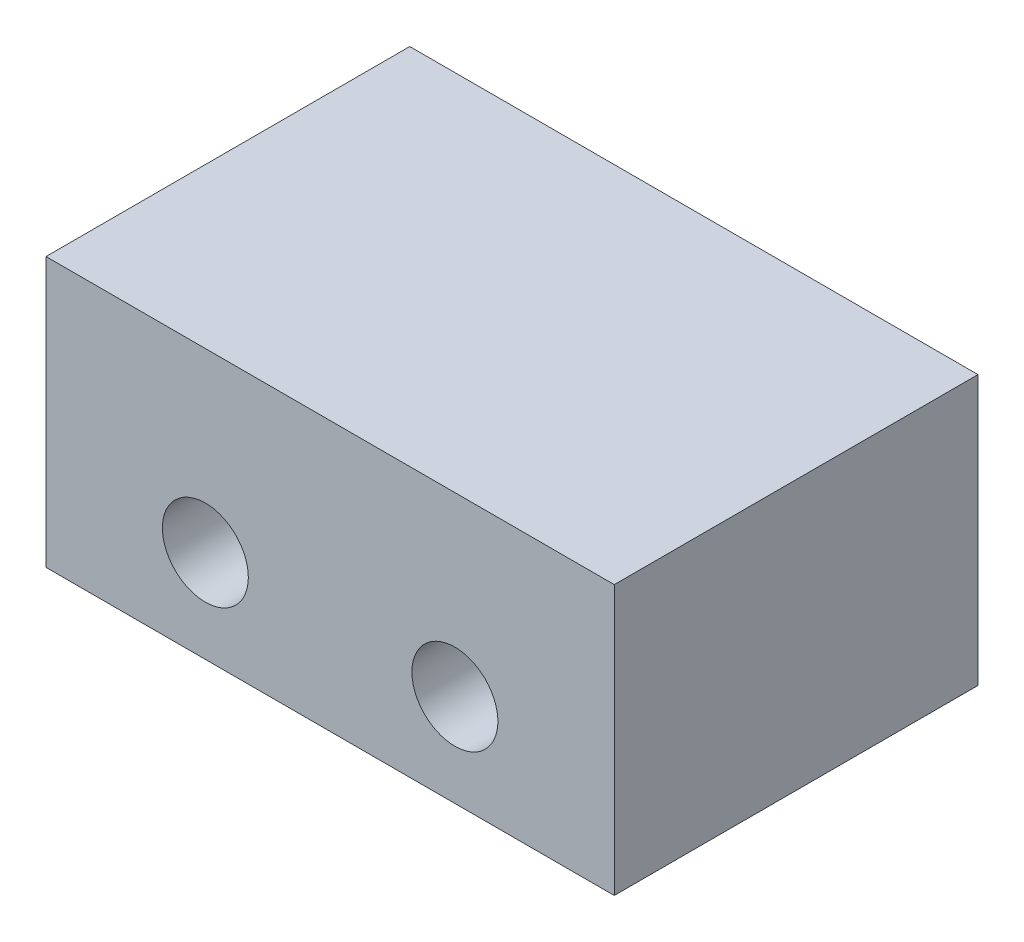
ISO-10303-21;
HEADER;
FILE_DESCRIPTION(('STEP AP214'),'2;1');
FILE_NAME('part.step','',(''),(''),'','','');
FILE_SCHEMA(('AUTOMOTIVE_DESIGN { 1 0 10303 214 1 1 1 1 }'));
ENDSEC;
DATA;
#1=APPLICATION_CONTEXT('core data for automotive mechanical design processes');
#2=APPLICATION_PROTOCOL_DEFINITION('international standard','automotive_design',2000,#1);
#3=PRODUCT_CONTEXT('',#1,'mechanical');
#4=PRODUCT('Part','Part','',(#3));
#5=PRODUCT_RELATED_PRODUCT_CATEGORY('part','',(#4));
#6=PRODUCT_DEFINITION_FORMATION('','',#4);
#7=PRODUCT_DEFINITION_CONTEXT('part definition',#1,'design');
#8=PRODUCT_DEFINITION('design','',#6,#7);
#9=PRODUCT_DEFINITION_SHAPE('','',#8);
#10=(LENGTH_UNIT() NAMED_UNIT(*) SI_UNIT(.MILLI.,.METRE.));
#11=(NAMED_UNIT(*) PLANE_ANGLE_UNIT() SI_UNIT($,.RADIAN.));
#12=(NAMED_UNIT(*) SI_UNIT($,.STERADIAN.) SOLID_ANGLE_UNIT());
#13=UNCERTAINTY_MEASURE_WITH_UNIT(LENGTH_MEASURE(1.E-05),#10,'distance_accuracy_value','');
#14=(GEOMETRIC_REPRESENTATION_CONTEXT(3) GLOBAL_UNCERTAINTY_ASSIGNED_CONTEXT((#13)) GLOBAL_UNIT_ASSIGNED_CONTEXT((#10,
#11,#12)) REPRESENTATION_CONTEXT('',''));
#15=CARTESIAN_POINT('',(0.,0.,0.));
#16=DIRECTION('',(0.,0.,1.));
#17=DIRECTION('',(1.,0.,0.));
#18=AXIS2_PLACEMENT_3D('',#15,#16,#17);
#19=CARTESIAN_POINT('',(0.,0.,12.7));
#20=DIRECTION('',(0.,0.,-1.));
#21=DIRECTION('',(-1.,0.,0.));
#22=AXIS2_PLACEMENT_3D('',#19,#20,#21);
#23=PLANE('',#22);
#24=DIRECTION('',(0.,-1.,0.));
#25=VECTOR('',#24,1.);
#26=CARTESIAN_POINT('',(0.,0.,12.7));
#27=LINE('',#26,#25);
#28=CARTESIAN_POINT('',(0.,9.4,12.7));
#29=VERTEX_POINT('',#28);
#30=CARTESIAN_POINT('',(0.,0.,12.7));
#31=VERTEX_POINT('',#30);
#32=EDGE_CURVE('E86',#29,#31,#27,.T.);
#33=ORIENTED_EDGE('',*,*,#32,.T.);
#34=DIRECTION('',(1.,0.,0.));
#35=VECTOR('',#34,1.);
#36=CARTESIAN_POINT('',(0.,0.,12.7));
#37=LINE('',#36,#35);
#38=CARTESIAN_POINT('',(19.84,0.,12.7));
#39=VERTEX_POINT('',#38);
#40=EDGE_CURVE('E81',#31,#39,#37,.T.);
#41=ORIENTED_EDGE('',*,*,#40,.T.);
#42=DIRECTION('',(0.,1.,0.));
#43=VECTOR('',#42,1.);
#44=CARTESIAN_POINT('',(19.84,0.,12.7));
#45=LINE('',#44,#43);
#46=CARTESIAN_POINT('',(19.84,9.4,12.7));
#47=VERTEX_POINT('',#46);
#48=EDGE_CURVE('E84',#39,#47,#45,.T.);
#49=ORIENTED_EDGE('',*,*,#48,.T.);
#50=DIRECTION('',(-1.,0.,0.));
#51=VECTOR('',#50,1.);
#52=CARTESIAN_POINT('',(0.,9.4,12.7));
#53=LINE('',#52,#51);
#54=EDGE_CURVE('E51',#47,#29,#53,.T.);
#55=ORIENTED_EDGE('',*,*,#54,.T.);
#56=EDGE_LOOP('',(#33,#41,#49,#55));
#57=FACE_BOUND('',#56,.T.);
#58=CARTESIAN_POINT('',(5.564,3.23,12.7));
#59=DIRECTION('',(0.,0.,1.));
#60=DIRECTION('',(1.,0.,0.));
#61=AXIS2_PLACEMENT_3D('',#58,#59,#60);
#62=CIRCLE('',#61,1.5);
#63=CARTESIAN_POINT('',(7.064,3.23,12.7));
#64=VERTEX_POINT('',#63);
#65=EDGE_CURVE('E101',#64,#64,#62,.T.);
#66=ORIENTED_EDGE('',*,*,#65,.F.);
#67=EDGE_LOOP('',(#66));
#68=FACE_BOUND('',#67,.T.);
#69=CARTESIAN_POINT('',(14.276,3.23,12.7));
#70=DIRECTION('',(0.,0.,1.));
#71=DIRECTION('',(-1.,0.,0.));
#72=AXIS2_PLACEMENT_3D('',#69,#70,#71);
#73=CIRCLE('',#72,1.5);
#74=CARTESIAN_POINT('',(12.776,3.23,12.7));
#75=VERTEX_POINT('',#74);
#76=EDGE_CURVE('E116',#75,#75,#73,.T.);
#77=ORIENTED_EDGE('',*,*,#76,.F.);
#78=EDGE_LOOP('',(#77));
#79=FACE_BOUND('',#78,.T.);
#80=ADVANCED_FACE('F34',(#57,#68,#79),#23,.F.);
#81=CARTESIAN_POINT('',(0.,0.,0.));
#82=DIRECTION('',(0.,0.,-1.));
#83=DIRECTION('',(-1.,0.,0.));
#84=AXIS2_PLACEMENT_3D('',#81,#82,#83);
#85=PLANE('',#84);
#86=CARTESIAN_POINT('',(5.564,3.23,0.));
#87=DIRECTION('',(0.,0.,1.));
#88=DIRECTION('',(1.,0.,0.));
#89=AXIS2_PLACEMENT_3D('',#86,#87,#88);
#90=CIRCLE('',#89,1.5);
#91=CARTESIAN_POINT('',(7.064,3.23,0.));
#92=VERTEX_POINT('',#91);
#93=EDGE_CURVE('E113',#92,#92,#90,.T.);
#94=ORIENTED_EDGE('',*,*,#93,.T.);
#95=EDGE_LOOP('',(#94));
#96=FACE_BOUND('',#95,.T.);
#97=DIRECTION('',(0.,-1.,0.));
#98=VECTOR('',#97,1.);
#99=CARTESIAN_POINT('',(0.,0.,0.));
#100=LINE('',#99,#98);
#101=CARTESIAN_POINT('',(0.,9.4,0.));
#102=VERTEX_POINT('',#101);
#103=CARTESIAN_POINT('',(0.,0.,0.));
#104=VERTEX_POINT('',#103);
#105=EDGE_CURVE('E98',#102,#104,#100,.T.);
#106=ORIENTED_EDGE('',*,*,#105,.F.);
#107=DIRECTION('',(-1.,0.,0.));
#108=VECTOR('',#107,1.);
#109=CARTESIAN_POINT('',(0.,9.4,0.));
#110=LINE('',#109,#108);
#111=CARTESIAN_POINT('',(19.84,9.4,0.));
#112=VERTEX_POINT('',#111);
#113=EDGE_CURVE('E74',#112,#102,#110,.T.);
#114=ORIENTED_EDGE('',*,*,#113,.F.);
#115=DIRECTION('',(0.,1.,0.));
#116=VECTOR('',#115,1.);
#117=CARTESIAN_POINT('',(19.84,0.,0.));
#118=LINE('',#117,#116);
#119=CARTESIAN_POINT('',(19.84,0.,0.));
#120=VERTEX_POINT('',#119);
#121=EDGE_CURVE('E68',#120,#112,#118,.T.);
#122=ORIENTED_EDGE('',*,*,#121,.F.);
#123=DIRECTION('',(1.,0.,0.));
#124=VECTOR('',#123,1.);
#125=CARTESIAN_POINT('',(0.,0.,0.));
#126=LINE('',#125,#124);
#127=EDGE_CURVE('E90',#104,#120,#126,.T.);
#128=ORIENTED_EDGE('',*,*,#127,.F.);
#129=EDGE_LOOP('',(#106,#114,#122,#128));
#130=FACE_BOUND('',#129,.T.);
#131=CARTESIAN_POINT('',(14.276,3.23,0.));
#132=DIRECTION('',(0.,0.,1.));
#133=DIRECTION('',(-1.,0.,0.));
#134=AXIS2_PLACEMENT_3D('',#131,#132,#133);
#135=CIRCLE('',#134,1.5);
#136=CARTESIAN_POINT('',(12.776,3.23,0.));
#137=VERTEX_POINT('',#136);
#138=EDGE_CURVE('E119',#137,#137,#135,.T.);
#139=ORIENTED_EDGE('',*,*,#138,.T.);
#140=EDGE_LOOP('',(#139));
#141=FACE_BOUND('',#140,.T.);
#142=ADVANCED_FACE('F109',(#96,#130,#141),#85,.T.);
#143=CARTESIAN_POINT('',(0.,0.,12.7));
#144=DIRECTION('',(1.,0.,0.));
#145=DIRECTION('',(0.,1.,0.));
#146=AXIS2_PLACEMENT_3D('',#143,#144,#145);
#147=PLANE('',#146);
#148=ORIENTED_EDGE('',*,*,#105,.T.);
#149=DIRECTION('',(0.,0.,-1.));
#150=VECTOR('',#149,1.);
#151=CARTESIAN_POINT('',(0.,0.,12.7));
#152=LINE('',#151,#150);
#153=EDGE_CURVE('E11',#31,#104,#152,.T.);
#154=ORIENTED_EDGE('',*,*,#153,.F.);
#155=ORIENTED_EDGE('',*,*,#32,.F.);
#156=DIRECTION('',(0.,0.,-1.));
#157=VECTOR('',#156,1.);
#158=CARTESIAN_POINT('',(0.,9.4,12.7));
#159=LINE('',#158,#157);
#160=EDGE_CURVE('E94',#29,#102,#159,.T.);
#161=ORIENTED_EDGE('',*,*,#160,.T.);
#162=EDGE_LOOP('',(#148,#154,#155,#161));
#163=FACE_BOUND('',#162,.T.);
#164=ADVANCED_FACE('F36',(#163),#147,.F.);
#165=CARTESIAN_POINT('',(0.,0.,12.7));
#166=DIRECTION('',(0.,1.,0.));
#167=DIRECTION('',(0.,0.,1.));
#168=AXIS2_PLACEMENT_3D('',#165,#166,#167);
#169=PLANE('',#168);
#170=ORIENTED_EDGE('',*,*,#127,.T.);
#171=DIRECTION('',(0.,0.,-1.));
#172=VECTOR('',#171,1.);
#173=CARTESIAN_POINT('',(19.84,0.,12.7));
#174=LINE('',#173,#172);
#175=EDGE_CURVE('E43',#39,#120,#174,.T.);
#176=ORIENTED_EDGE('',*,*,#175,.F.);
#177=ORIENTED_EDGE('',*,*,#40,.F.);
#178=ORIENTED_EDGE('',*,*,#153,.T.);
#179=EDGE_LOOP('',(#170,#176,#177,#178));
#180=FACE_BOUND('',#179,.T.);
#181=ADVANCED_FACE('F89',(#180),#169,.F.);
#182=CARTESIAN_POINT('',(19.84,0.,12.7));
#183=DIRECTION('',(-1.,0.,0.));
#184=DIRECTION('',(0.,-1.,0.));
#185=AXIS2_PLACEMENT_3D('',#182,#183,#184);
#186=PLANE('',#185);
#187=ORIENTED_EDGE('',*,*,#121,.T.);
#188=DIRECTION('',(0.,0.,-1.));
#189=VECTOR('',#188,1.);
#190=CARTESIAN_POINT('',(19.84,9.4,12.7));
#191=LINE('',#190,#189);
#192=EDGE_CURVE('E91',#47,#112,#191,.T.);
#193=ORIENTED_EDGE('',*,*,#192,.F.);
#194=ORIENTED_EDGE('',*,*,#48,.F.);
#195=ORIENTED_EDGE('',*,*,#175,.T.);
#196=EDGE_LOOP('',(#187,#193,#194,#195));
#197=FACE_BOUND('',#196,.T.);
#198=ADVANCED_FACE('F92',(#197),#186,.F.);
#199=CARTESIAN_POINT('',(0.,9.4,12.7));
#200=DIRECTION('',(0.,-1.,0.));
#201=DIRECTION('',(0.,0.,-1.));
#202=AXIS2_PLACEMENT_3D('',#199,#200,#201);
#203=PLANE('',#202);
#204=ORIENTED_EDGE('',*,*,#113,.T.);
#205=ORIENTED_EDGE('',*,*,#160,.F.);
#206=ORIENTED_EDGE('',*,*,#54,.F.);
#207=ORIENTED_EDGE('',*,*,#192,.T.);
#208=EDGE_LOOP('',(#204,#205,#206,#207));
#209=FACE_BOUND('',#208,.T.);
#210=ADVANCED_FACE('F106',(#209),#203,.F.);
#211=CARTESIAN_POINT('',(5.564,3.23,12.7));
#212=DIRECTION('',(0.,0.,-1.));
#213=DIRECTION('',(-1.,0.,0.));
#214=AXIS2_PLACEMENT_3D('',#211,#212,#213);
#215=CYLINDRICAL_SURFACE('',#214,1.5);
#216=ORIENTED_EDGE('',*,*,#65,.T.);
#217=EDGE_LOOP('',(#216));
#218=FACE_BOUND('',#217,.T.);
#219=ORIENTED_EDGE('',*,*,#93,.F.);
#220=EDGE_LOOP('',(#219));
#221=FACE_BOUND('',#220,.T.);
#222=ADVANCED_FACE('F136',(#218,#221),#215,.F.);
#223=CARTESIAN_POINT('',(14.276,3.23,12.7));
#224=DIRECTION('',(0.,0.,-1.));
#225=DIRECTION('',(-1.,0.,0.));
#226=AXIS2_PLACEMENT_3D('',#223,#224,#225);
#227=CYLINDRICAL_SURFACE('',#226,1.5);
#228=ORIENTED_EDGE('',*,*,#76,.T.);
#229=EDGE_LOOP('',(#228));
#230=FACE_BOUND('',#229,.T.);
#231=ORIENTED_EDGE('',*,*,#138,.F.);
#232=EDGE_LOOP('',(#231));
#233=FACE_BOUND('',#232,.T.);
#234=ADVANCED_FACE('F125',(#230,#233),#227,.F.);
#235=CLOSED_SHELL('',(#80,#142,#164,#181,#198,#210,#222,#234));
#236=MANIFOLD_SOLID_BREP('B2',#235);
#237=ADVANCED_BREP_SHAPE_REPRESENTATION('',(#18,#236),#14);
#238=SHAPE_DEFINITION_REPRESENTATION(#9,#237);
ENDSEC;
END-ISO-10303-21;
